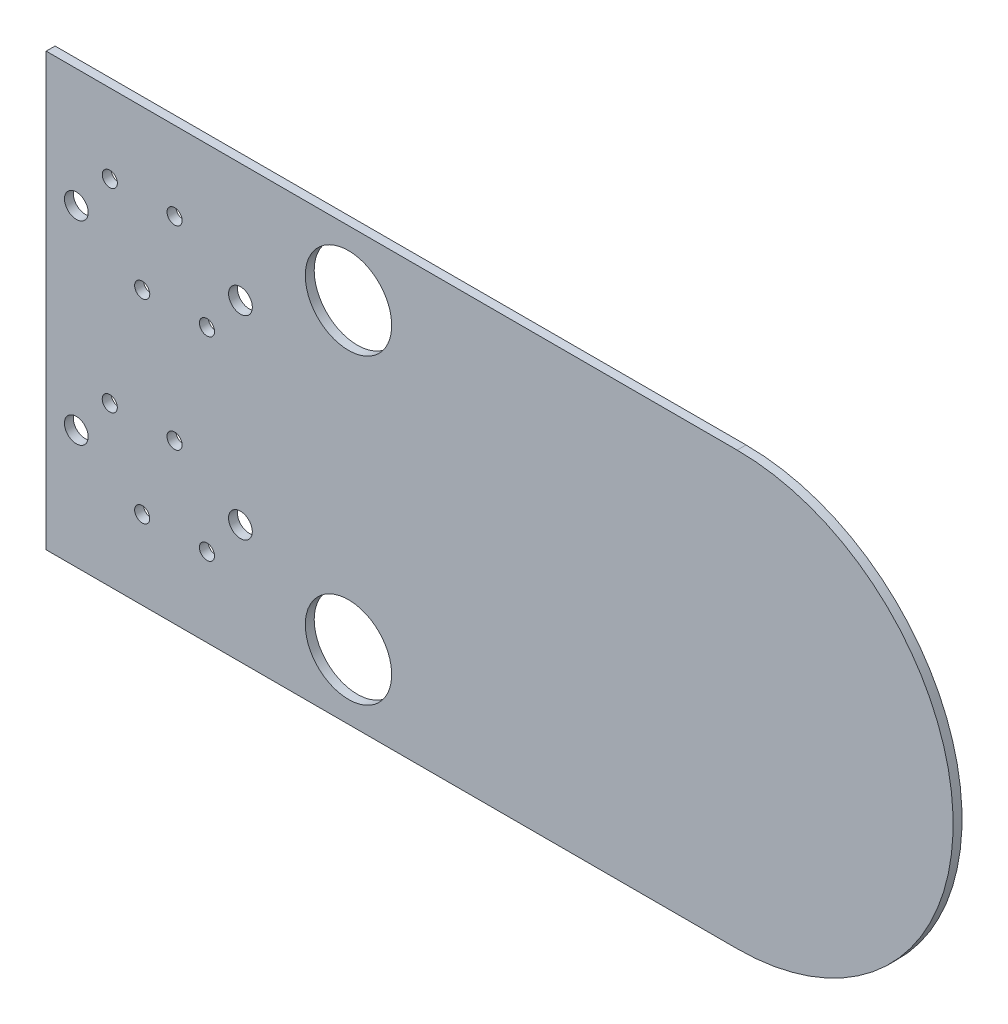
ISO-10303-21;
HEADER;
FILE_DESCRIPTION(('STEP AP214'),'2;1');
FILE_NAME('part.step','',(''),(''),'','','');
FILE_SCHEMA(('AUTOMOTIVE_DESIGN { 1 0 10303 214 1 1 1 1 }'));
ENDSEC;
DATA;
#1=APPLICATION_CONTEXT('core data for automotive mechanical design processes');
#2=APPLICATION_PROTOCOL_DEFINITION('international standard','automotive_design',2000,#1);
#3=PRODUCT_CONTEXT('',#1,'mechanical');
#4=PRODUCT('Part','Part','',(#3));
#5=PRODUCT_RELATED_PRODUCT_CATEGORY('part','',(#4));
#6=PRODUCT_DEFINITION_FORMATION('','',#4);
#7=PRODUCT_DEFINITION_CONTEXT('part definition',#1,'design');
#8=PRODUCT_DEFINITION('design','',#6,#7);
#9=PRODUCT_DEFINITION_SHAPE('','',#8);
#10=(LENGTH_UNIT() NAMED_UNIT(*) SI_UNIT(.MILLI.,.METRE.));
#11=(NAMED_UNIT(*) PLANE_ANGLE_UNIT() SI_UNIT($,.RADIAN.));
#12=(NAMED_UNIT(*) SI_UNIT($,.STERADIAN.) SOLID_ANGLE_UNIT());
#13=UNCERTAINTY_MEASURE_WITH_UNIT(LENGTH_MEASURE(1.E-05),#10,'distance_accuracy_value','');
#14=(GEOMETRIC_REPRESENTATION_CONTEXT(3) GLOBAL_UNCERTAINTY_ASSIGNED_CONTEXT((#13)) GLOBAL_UNIT_ASSIGNED_CONTEXT((#10,
#11,#12)) REPRESENTATION_CONTEXT('',''));
#15=CARTESIAN_POINT('',(0.,0.,0.));
#16=DIRECTION('',(0.,0.,1.));
#17=DIRECTION('',(1.,0.,0.));
#18=AXIS2_PLACEMENT_3D('',#15,#16,#17);
#19=CARTESIAN_POINT('',(18.922851585587,0.,0.41148));
#20=DIRECTION('',(0.,0.,-1.));
#21=DIRECTION('',(-1.,0.,0.));
#22=AXIS2_PLACEMENT_3D('',#19,#20,#21);
#23=PLANE('',#22);
#24=CARTESIAN_POINT('',(14.,7.,0.41148));
#25=DIRECTION('',(0.,0.,-1.));
#26=DIRECTION('',(-1.,0.,0.));
#27=AXIS2_PLACEMENT_3D('',#24,#25,#26);
#28=CIRCLE('',#27,2.);
#29=CARTESIAN_POINT('',(12.,7.,0.41148));
#30=VERTEX_POINT('',#29);
#31=EDGE_CURVE('E82',#30,#30,#28,.T.);
#32=ORIENTED_EDGE('',*,*,#31,.T.);
#33=EDGE_LOOP('',(#32));
#34=FACE_BOUND('',#33,.T.);
#35=CARTESIAN_POINT('',(8.997,4.5,0.41148));
#36=DIRECTION('',(0.,0.,-1.));
#37=DIRECTION('',(-1.,0.,0.));
#38=AXIS2_PLACEMENT_3D('',#35,#36,#37);
#39=CIRCLE('',#38,0.55);
#40=CARTESIAN_POINT('',(8.447,4.5,0.41148));
#41=VERTEX_POINT('',#40);
#42=EDGE_CURVE('E85',#41,#41,#39,.T.);
#43=ORIENTED_EDGE('',*,*,#42,.T.);
#44=EDGE_LOOP('',(#43));
#45=FACE_BOUND('',#44,.T.);
#46=CARTESIAN_POINT('',(5.947,6.35,0.41148));
#47=DIRECTION('',(0.,0.,-1.));
#48=DIRECTION('',(-1.,0.,0.));
#49=AXIS2_PLACEMENT_3D('',#46,#47,#48);
#50=CIRCLE('',#49,0.35);
#51=CARTESIAN_POINT('',(5.597,6.35,0.41148));
#52=VERTEX_POINT('',#51);
#53=EDGE_CURVE('E149',#52,#52,#50,.T.);
#54=ORIENTED_EDGE('',*,*,#53,.T.);
#55=EDGE_LOOP('',(#54));
#56=FACE_BOUND('',#55,.T.);
#57=CARTESIAN_POINT('',(7.447,2.65,0.41148));
#58=DIRECTION('',(0.,0.,-1.));
#59=DIRECTION('',(-1.,0.,0.));
#60=AXIS2_PLACEMENT_3D('',#57,#58,#59);
#61=CIRCLE('',#60,0.35);
#62=CARTESIAN_POINT('',(7.097,2.65,0.41148));
#63=VERTEX_POINT('',#62);
#64=EDGE_CURVE('E152',#63,#63,#61,.T.);
#65=ORIENTED_EDGE('',*,*,#64,.T.);
#66=EDGE_LOOP('',(#65));
#67=FACE_BOUND('',#66,.T.);
#68=CARTESIAN_POINT('',(8.995,-4.5,0.41148));
#69=DIRECTION('',(0.,0.,-1.));
#70=DIRECTION('',(-1.,0.,0.));
#71=AXIS2_PLACEMENT_3D('',#68,#69,#70);
#72=CIRCLE('',#71,0.55);
#73=CARTESIAN_POINT('',(8.445,-4.5,0.41148));
#74=VERTEX_POINT('',#73);
#75=EDGE_CURVE('E155',#74,#74,#72,.T.);
#76=ORIENTED_EDGE('',*,*,#75,.T.);
#77=EDGE_LOOP('',(#76));
#78=FACE_BOUND('',#77,.T.);
#79=CARTESIAN_POINT('',(14.,-7.,0.41148));
#80=DIRECTION('',(0.,0.,-1.));
#81=DIRECTION('',(-1.,0.,0.));
#82=AXIS2_PLACEMENT_3D('',#79,#80,#81);
#83=CIRCLE('',#82,2.);
#84=CARTESIAN_POINT('',(12.,-7.,0.41148));
#85=VERTEX_POINT('',#84);
#86=EDGE_CURVE('E158',#85,#85,#83,.T.);
#87=ORIENTED_EDGE('',*,*,#86,.T.);
#88=EDGE_LOOP('',(#87));
#89=FACE_BOUND('',#88,.T.);
#90=CARTESIAN_POINT('',(7.445,-6.35,0.41148));
#91=DIRECTION('',(0.,0.,-1.));
#92=DIRECTION('',(-1.,0.,0.));
#93=AXIS2_PLACEMENT_3D('',#90,#91,#92);
#94=CIRCLE('',#93,0.35);
#95=CARTESIAN_POINT('',(7.095,-6.35,0.41148));
#96=VERTEX_POINT('',#95);
#97=EDGE_CURVE('E161',#96,#96,#94,.T.);
#98=ORIENTED_EDGE('',*,*,#97,.T.);
#99=EDGE_LOOP('',(#98));
#100=FACE_BOUND('',#99,.T.);
#101=CARTESIAN_POINT('',(4.447,2.65,0.41148));
#102=DIRECTION('',(0.,0.,-1.));
#103=DIRECTION('',(-1.,0.,0.));
#104=AXIS2_PLACEMENT_3D('',#101,#102,#103);
#105=CIRCLE('',#104,0.35);
#106=CARTESIAN_POINT('',(4.097,2.65,0.41148));
#107=VERTEX_POINT('',#106);
#108=EDGE_CURVE('E164',#107,#107,#105,.T.);
#109=ORIENTED_EDGE('',*,*,#108,.T.);
#110=EDGE_LOOP('',(#109));
#111=FACE_BOUND('',#110,.T.);
#112=CARTESIAN_POINT('',(5.945,-2.65,0.41148));
#113=DIRECTION('',(0.,0.,-1.));
#114=DIRECTION('',(-1.,0.,0.));
#115=AXIS2_PLACEMENT_3D('',#112,#113,#114);
#116=CIRCLE('',#115,0.35);
#117=CARTESIAN_POINT('',(5.595,-2.65,0.41148));
#118=VERTEX_POINT('',#117);
#119=EDGE_CURVE('E167',#118,#118,#116,.T.);
#120=ORIENTED_EDGE('',*,*,#119,.T.);
#121=EDGE_LOOP('',(#120));
#122=FACE_BOUND('',#121,.T.);
#123=CARTESIAN_POINT('',(2.947,6.35,0.41148));
#124=DIRECTION('',(0.,0.,-1.));
#125=DIRECTION('',(-1.,0.,0.));
#126=AXIS2_PLACEMENT_3D('',#123,#124,#125);
#127=CIRCLE('',#126,0.35);
#128=CARTESIAN_POINT('',(2.597,6.35,0.41148));
#129=VERTEX_POINT('',#128);
#130=EDGE_CURVE('E170',#129,#129,#127,.T.);
#131=ORIENTED_EDGE('',*,*,#130,.T.);
#132=EDGE_LOOP('',(#131));
#133=FACE_BOUND('',#132,.T.);
#134=CARTESIAN_POINT('',(1.397,4.5,0.41148));
#135=DIRECTION('',(0.,0.,-1.));
#136=DIRECTION('',(-1.,0.,0.));
#137=AXIS2_PLACEMENT_3D('',#134,#135,#136);
#138=CIRCLE('',#137,0.55);
#139=CARTESIAN_POINT('',(0.847,4.5,0.41148));
#140=VERTEX_POINT('',#139);
#141=EDGE_CURVE('E173',#140,#140,#138,.T.);
#142=ORIENTED_EDGE('',*,*,#141,.T.);
#143=EDGE_LOOP('',(#142));
#144=FACE_BOUND('',#143,.T.);
#145=CARTESIAN_POINT('',(2.945,-2.65,0.41148));
#146=DIRECTION('',(0.,0.,-1.));
#147=DIRECTION('',(-1.,0.,0.));
#148=AXIS2_PLACEMENT_3D('',#145,#146,#147);
#149=CIRCLE('',#148,0.35);
#150=CARTESIAN_POINT('',(2.595,-2.65,0.41148));
#151=VERTEX_POINT('',#150);
#152=EDGE_CURVE('E176',#151,#151,#149,.T.);
#153=ORIENTED_EDGE('',*,*,#152,.T.);
#154=EDGE_LOOP('',(#153));
#155=FACE_BOUND('',#154,.T.);
#156=CARTESIAN_POINT('',(4.445,-6.35,0.41148));
#157=DIRECTION('',(0.,0.,-1.));
#158=DIRECTION('',(-1.,0.,0.));
#159=AXIS2_PLACEMENT_3D('',#156,#157,#158);
#160=CIRCLE('',#159,0.35);
#161=CARTESIAN_POINT('',(4.095,-6.35,0.41148));
#162=VERTEX_POINT('',#161);
#163=EDGE_CURVE('E179',#162,#162,#160,.T.);
#164=ORIENTED_EDGE('',*,*,#163,.T.);
#165=EDGE_LOOP('',(#164));
#166=FACE_BOUND('',#165,.T.);
#167=CARTESIAN_POINT('',(1.395,-4.5,0.41148));
#168=DIRECTION('',(0.,0.,-1.));
#169=DIRECTION('',(-1.,0.,0.));
#170=AXIS2_PLACEMENT_3D('',#167,#168,#169);
#171=CIRCLE('',#170,0.55);
#172=CARTESIAN_POINT('',(0.845,-4.5,0.41148));
#173=VERTEX_POINT('',#172);
#174=EDGE_CURVE('E181',#173,#173,#171,.T.);
#175=ORIENTED_EDGE('',*,*,#174,.T.);
#176=EDGE_LOOP('',(#175));
#177=FACE_BOUND('',#176,.T.);
#178=CARTESIAN_POINT('',(32.,0.,0.41148));
#179=DIRECTION('',(0.,0.,-1.));
#180=DIRECTION('',(-1.,0.,0.));
#181=AXIS2_PLACEMENT_3D('',#178,#179,#180);
#182=CIRCLE('',#181,10.);
#183=CARTESIAN_POINT('',(32.,10.,0.41148));
#184=VERTEX_POINT('',#183);
#185=CARTESIAN_POINT('',(32.,-10.,0.41148));
#186=VERTEX_POINT('',#185);
#187=EDGE_CURVE('E20',#184,#186,#182,.T.);
#188=ORIENTED_EDGE('',*,*,#187,.F.);
#189=DIRECTION('',(1.,0.,0.));
#190=VECTOR('',#189,1.);
#191=CARTESIAN_POINT('',(0.,10.,0.41148));
#192=LINE('',#191,#190);
#193=CARTESIAN_POINT('',(0.,10.,0.41148));
#194=VERTEX_POINT('',#193);
#195=EDGE_CURVE('E47',#194,#184,#192,.T.);
#196=ORIENTED_EDGE('',*,*,#195,.F.);
#197=DIRECTION('',(0.,1.,0.));
#198=VECTOR('',#197,1.);
#199=CARTESIAN_POINT('',(0.,-10.,0.41148));
#200=LINE('',#199,#198);
#201=CARTESIAN_POINT('',(0.,-10.,0.41148));
#202=VERTEX_POINT('',#201);
#203=EDGE_CURVE('E56',#202,#194,#200,.T.);
#204=ORIENTED_EDGE('',*,*,#203,.F.);
#205=DIRECTION('',(1.,0.,0.));
#206=VECTOR('',#205,1.);
#207=CARTESIAN_POINT('',(32.,-10.,0.41148));
#208=LINE('',#207,#206);
#209=EDGE_CURVE('E99',#186,#202,#208,.F.);
#210=ORIENTED_EDGE('',*,*,#209,.F.);
#211=EDGE_LOOP('',(#188,#196,#204,#210));
#212=FACE_BOUND('',#211,.T.);
#213=ADVANCED_FACE('F17',(#34,#45,#56,#67,#78,#89,#100,#111,#122,#133,#144,#155,#166,#177,#212),
#23,.F.);
#214=CARTESIAN_POINT('',(0.,-10.,0.));
#215=DIRECTION('',(-1.,0.,0.));
#216=DIRECTION('',(0.,0.,1.));
#217=AXIS2_PLACEMENT_3D('',#214,#215,#216);
#218=PLANE('',#217);
#219=DIRECTION('',(0.,0.,1.));
#220=VECTOR('',#219,1.);
#221=CARTESIAN_POINT('',(0.,10.,0.));
#222=LINE('',#221,#220);
#223=CARTESIAN_POINT('',(0.,10.,0.));
#224=VERTEX_POINT('',#223);
#225=EDGE_CURVE('E66',#224,#194,#222,.T.);
#226=ORIENTED_EDGE('',*,*,#225,.F.);
#227=DIRECTION('',(0.,1.,0.));
#228=VECTOR('',#227,1.);
#229=CARTESIAN_POINT('',(0.,0.,0.));
#230=LINE('',#229,#228);
#231=CARTESIAN_POINT('',(0.,-10.,0.));
#232=VERTEX_POINT('',#231);
#233=EDGE_CURVE('E64',#232,#224,#230,.T.);
#234=ORIENTED_EDGE('',*,*,#233,.F.);
#235=DIRECTION('',(0.,0.,-1.));
#236=VECTOR('',#235,1.);
#237=CARTESIAN_POINT('',(0.,-10.,0.));
#238=LINE('',#237,#236);
#239=EDGE_CURVE('E102',#202,#232,#238,.T.);
#240=ORIENTED_EDGE('',*,*,#239,.F.);
#241=ORIENTED_EDGE('',*,*,#203,.T.);
#242=EDGE_LOOP('',(#226,#234,#240,#241));
#243=FACE_BOUND('',#242,.T.);
#244=ADVANCED_FACE('F68',(#243),#218,.T.);
#245=CARTESIAN_POINT('',(0.,10.,0.));
#246=DIRECTION('',(0.,1.,0.));
#247=DIRECTION('',(0.,0.,1.));
#248=AXIS2_PLACEMENT_3D('',#245,#246,#247);
#249=PLANE('',#248);
#250=DIRECTION('',(0.,0.,-1.));
#251=VECTOR('',#250,1.);
#252=CARTESIAN_POINT('',(32.,10.,0.));
#253=LINE('',#252,#251);
#254=CARTESIAN_POINT('',(32.,10.,0.));
#255=VERTEX_POINT('',#254);
#256=EDGE_CURVE('E74',#255,#184,#253,.F.);
#257=ORIENTED_EDGE('',*,*,#256,.F.);
#258=DIRECTION('',(-1.,0.,0.));
#259=VECTOR('',#258,1.);
#260=CARTESIAN_POINT('',(18.922851585587,10.,0.));
#261=LINE('',#260,#259);
#262=EDGE_CURVE('E71',#224,#255,#261,.F.);
#263=ORIENTED_EDGE('',*,*,#262,.F.);
#264=ORIENTED_EDGE('',*,*,#225,.T.);
#265=ORIENTED_EDGE('',*,*,#195,.T.);
#266=EDGE_LOOP('',(#257,#263,#264,#265));
#267=FACE_BOUND('',#266,.T.);
#268=ADVANCED_FACE('F72',(#267),#249,.T.);
#269=CARTESIAN_POINT('',(32.,0.,0.));
#270=DIRECTION('',(0.,0.,-1.));
#271=DIRECTION('',(-1.,0.,0.));
#272=AXIS2_PLACEMENT_3D('',#269,#270,#271);
#273=CYLINDRICAL_SURFACE('',#272,10.);
#274=DIRECTION('',(0.,0.,-1.));
#275=VECTOR('',#274,1.);
#276=CARTESIAN_POINT('',(32.,-10.,0.));
#277=LINE('',#276,#275);
#278=CARTESIAN_POINT('',(32.,-10.,0.));
#279=VERTEX_POINT('',#278);
#280=EDGE_CURVE('E35',#279,#186,#277,.F.);
#281=ORIENTED_EDGE('',*,*,#280,.F.);
#282=CARTESIAN_POINT('',(32.,0.,0.));
#283=DIRECTION('',(0.,0.,-1.));
#284=DIRECTION('',(-1.,0.,0.));
#285=AXIS2_PLACEMENT_3D('',#282,#283,#284);
#286=CIRCLE('',#285,10.);
#287=EDGE_CURVE('E77',#255,#279,#286,.T.);
#288=ORIENTED_EDGE('',*,*,#287,.F.);
#289=ORIENTED_EDGE('',*,*,#256,.T.);
#290=ORIENTED_EDGE('',*,*,#187,.T.);
#291=EDGE_LOOP('',(#281,#288,#289,#290));
#292=FACE_BOUND('',#291,.T.);
#293=ADVANCED_FACE('F192',(#292),#273,.T.);
#294=CARTESIAN_POINT('',(32.,-10.,0.));
#295=DIRECTION('',(0.,-1.,0.));
#296=DIRECTION('',(0.,0.,-1.));
#297=AXIS2_PLACEMENT_3D('',#294,#295,#296);
#298=PLANE('',#297);
#299=ORIENTED_EDGE('',*,*,#239,.T.);
#300=DIRECTION('',(-1.,0.,0.));
#301=VECTOR('',#300,1.);
#302=CARTESIAN_POINT('',(18.922851585587,-10.,0.));
#303=LINE('',#302,#301);
#304=EDGE_CURVE('E81',#279,#232,#303,.T.);
#305=ORIENTED_EDGE('',*,*,#304,.F.);
#306=ORIENTED_EDGE('',*,*,#280,.T.);
#307=ORIENTED_EDGE('',*,*,#209,.T.);
#308=EDGE_LOOP('',(#299,#305,#306,#307));
#309=FACE_BOUND('',#308,.T.);
#310=ADVANCED_FACE('F193',(#309),#298,.T.);
#311=CARTESIAN_POINT('',(1.395,-4.5,0.));
#312=DIRECTION('',(0.,0.,-1.));
#313=DIRECTION('',(-1.,0.,0.));
#314=AXIS2_PLACEMENT_3D('',#311,#312,#313);
#315=CYLINDRICAL_SURFACE('',#314,0.55);
#316=ORIENTED_EDGE('',*,*,#174,.F.);
#317=EDGE_LOOP('',(#316));
#318=FACE_BOUND('',#317,.T.);
#319=CARTESIAN_POINT('',(1.395,-4.5,0.));
#320=DIRECTION('',(0.,0.,-1.));
#321=DIRECTION('',(-1.,0.,0.));
#322=AXIS2_PLACEMENT_3D('',#319,#320,#321);
#323=CIRCLE('',#322,0.55);
#324=CARTESIAN_POINT('',(0.845,-4.5,0.));
#325=VERTEX_POINT('',#324);
#326=EDGE_CURVE('E143',#325,#325,#323,.F.);
#327=ORIENTED_EDGE('',*,*,#326,.F.);
#328=EDGE_LOOP('',(#327));
#329=FACE_BOUND('',#328,.T.);
#330=ADVANCED_FACE('F195',(#318,#329),#315,.F.);
#331=CARTESIAN_POINT('',(4.445,-6.35,0.));
#332=DIRECTION('',(0.,0.,-1.));
#333=DIRECTION('',(-1.,0.,0.));
#334=AXIS2_PLACEMENT_3D('',#331,#332,#333);
#335=CYLINDRICAL_SURFACE('',#334,0.35);
#336=ORIENTED_EDGE('',*,*,#163,.F.);
#337=EDGE_LOOP('',(#336));
#338=FACE_BOUND('',#337,.T.);
#339=CARTESIAN_POINT('',(4.445,-6.35,0.));
#340=DIRECTION('',(0.,0.,-1.));
#341=DIRECTION('',(-1.,0.,0.));
#342=AXIS2_PLACEMENT_3D('',#339,#340,#341);
#343=CIRCLE('',#342,0.35);
#344=CARTESIAN_POINT('',(4.095,-6.35,0.));
#345=VERTEX_POINT('',#344);
#346=EDGE_CURVE('E140',#345,#345,#343,.F.);
#347=ORIENTED_EDGE('',*,*,#346,.F.);
#348=EDGE_LOOP('',(#347));
#349=FACE_BOUND('',#348,.T.);
#350=ADVANCED_FACE('F202',(#338,#349),#335,.F.);
#351=CARTESIAN_POINT('',(2.945,-2.65,0.));
#352=DIRECTION('',(0.,0.,-1.));
#353=DIRECTION('',(-1.,0.,0.));
#354=AXIS2_PLACEMENT_3D('',#351,#352,#353);
#355=CYLINDRICAL_SURFACE('',#354,0.35);
#356=ORIENTED_EDGE('',*,*,#152,.F.);
#357=EDGE_LOOP('',(#356));
#358=FACE_BOUND('',#357,.T.);
#359=CARTESIAN_POINT('',(2.945,-2.65,0.));
#360=DIRECTION('',(0.,0.,-1.));
#361=DIRECTION('',(-1.,0.,0.));
#362=AXIS2_PLACEMENT_3D('',#359,#360,#361);
#363=CIRCLE('',#362,0.35);
#364=CARTESIAN_POINT('',(2.595,-2.65,0.));
#365=VERTEX_POINT('',#364);
#366=EDGE_CURVE('E137',#365,#365,#363,.F.);
#367=ORIENTED_EDGE('',*,*,#366,.F.);
#368=EDGE_LOOP('',(#367));
#369=FACE_BOUND('',#368,.T.);
#370=ADVANCED_FACE('F256',(#358,#369),#355,.F.);
#371=CARTESIAN_POINT('',(1.397,4.5,0.));
#372=DIRECTION('',(0.,0.,-1.));
#373=DIRECTION('',(-1.,0.,0.));
#374=AXIS2_PLACEMENT_3D('',#371,#372,#373);
#375=CYLINDRICAL_SURFACE('',#374,0.55);
#376=ORIENTED_EDGE('',*,*,#141,.F.);
#377=EDGE_LOOP('',(#376));
#378=FACE_BOUND('',#377,.T.);
#379=CARTESIAN_POINT('',(1.397,4.5,0.));
#380=DIRECTION('',(0.,0.,-1.));
#381=DIRECTION('',(-1.,0.,0.));
#382=AXIS2_PLACEMENT_3D('',#379,#380,#381);
#383=CIRCLE('',#382,0.55);
#384=CARTESIAN_POINT('',(0.847,4.5,0.));
#385=VERTEX_POINT('',#384);
#386=EDGE_CURVE('E134',#385,#385,#383,.F.);
#387=ORIENTED_EDGE('',*,*,#386,.F.);
#388=EDGE_LOOP('',(#387));
#389=FACE_BOUND('',#388,.T.);
#390=ADVANCED_FACE('F252',(#378,#389),#375,.F.);
#391=CARTESIAN_POINT('',(2.947,6.35,0.));
#392=DIRECTION('',(0.,0.,-1.));
#393=DIRECTION('',(-1.,0.,0.));
#394=AXIS2_PLACEMENT_3D('',#391,#392,#393);
#395=CYLINDRICAL_SURFACE('',#394,0.35);
#396=ORIENTED_EDGE('',*,*,#130,.F.);
#397=EDGE_LOOP('',(#396));
#398=FACE_BOUND('',#397,.T.);
#399=CARTESIAN_POINT('',(2.947,6.35,0.));
#400=DIRECTION('',(0.,0.,-1.));
#401=DIRECTION('',(-1.,0.,0.));
#402=AXIS2_PLACEMENT_3D('',#399,#400,#401);
#403=CIRCLE('',#402,0.35);
#404=CARTESIAN_POINT('',(2.597,6.35,0.));
#405=VERTEX_POINT('',#404);
#406=EDGE_CURVE('E131',#405,#405,#403,.F.);
#407=ORIENTED_EDGE('',*,*,#406,.F.);
#408=EDGE_LOOP('',(#407));
#409=FACE_BOUND('',#408,.T.);
#410=ADVANCED_FACE('F248',(#398,#409),#395,.F.);
#411=CARTESIAN_POINT('',(5.945,-2.65,0.));
#412=DIRECTION('',(0.,0.,-1.));
#413=DIRECTION('',(-1.,0.,0.));
#414=AXIS2_PLACEMENT_3D('',#411,#412,#413);
#415=CYLINDRICAL_SURFACE('',#414,0.35);
#416=ORIENTED_EDGE('',*,*,#119,.F.);
#417=EDGE_LOOP('',(#416));
#418=FACE_BOUND('',#417,.T.);
#419=CARTESIAN_POINT('',(5.945,-2.65,0.));
#420=DIRECTION('',(0.,0.,-1.));
#421=DIRECTION('',(-1.,0.,0.));
#422=AXIS2_PLACEMENT_3D('',#419,#420,#421);
#423=CIRCLE('',#422,0.35);
#424=CARTESIAN_POINT('',(5.595,-2.65,0.));
#425=VERTEX_POINT('',#424);
#426=EDGE_CURVE('E128',#425,#425,#423,.F.);
#427=ORIENTED_EDGE('',*,*,#426,.F.);
#428=EDGE_LOOP('',(#427));
#429=FACE_BOUND('',#428,.T.);
#430=ADVANCED_FACE('F244',(#418,#429),#415,.F.);
#431=CARTESIAN_POINT('',(4.447,2.65,0.));
#432=DIRECTION('',(0.,0.,-1.));
#433=DIRECTION('',(-1.,0.,0.));
#434=AXIS2_PLACEMENT_3D('',#431,#432,#433);
#435=CYLINDRICAL_SURFACE('',#434,0.35);
#436=ORIENTED_EDGE('',*,*,#108,.F.);
#437=EDGE_LOOP('',(#436));
#438=FACE_BOUND('',#437,.T.);
#439=CARTESIAN_POINT('',(4.447,2.65,0.));
#440=DIRECTION('',(0.,0.,-1.));
#441=DIRECTION('',(-1.,0.,0.));
#442=AXIS2_PLACEMENT_3D('',#439,#440,#441);
#443=CIRCLE('',#442,0.35);
#444=CARTESIAN_POINT('',(4.097,2.65,0.));
#445=VERTEX_POINT('',#444);
#446=EDGE_CURVE('E125',#445,#445,#443,.F.);
#447=ORIENTED_EDGE('',*,*,#446,.F.);
#448=EDGE_LOOP('',(#447));
#449=FACE_BOUND('',#448,.T.);
#450=ADVANCED_FACE('F240',(#438,#449),#435,.F.);
#451=CARTESIAN_POINT('',(7.445,-6.35,0.));
#452=DIRECTION('',(0.,0.,-1.));
#453=DIRECTION('',(-1.,0.,0.));
#454=AXIS2_PLACEMENT_3D('',#451,#452,#453);
#455=CYLINDRICAL_SURFACE('',#454,0.35);
#456=ORIENTED_EDGE('',*,*,#97,.F.);
#457=EDGE_LOOP('',(#456));
#458=FACE_BOUND('',#457,.T.);
#459=CARTESIAN_POINT('',(7.445,-6.35,0.));
#460=DIRECTION('',(0.,0.,-1.));
#461=DIRECTION('',(-1.,0.,0.));
#462=AXIS2_PLACEMENT_3D('',#459,#460,#461);
#463=CIRCLE('',#462,0.35);
#464=CARTESIAN_POINT('',(7.095,-6.35,0.));
#465=VERTEX_POINT('',#464);
#466=EDGE_CURVE('E122',#465,#465,#463,.F.);
#467=ORIENTED_EDGE('',*,*,#466,.F.);
#468=EDGE_LOOP('',(#467));
#469=FACE_BOUND('',#468,.T.);
#470=ADVANCED_FACE('F236',(#458,#469),#455,.F.);
#471=CARTESIAN_POINT('',(14.,-7.,0.));
#472=DIRECTION('',(0.,0.,-1.));
#473=DIRECTION('',(-1.,0.,0.));
#474=AXIS2_PLACEMENT_3D('',#471,#472,#473);
#475=CYLINDRICAL_SURFACE('',#474,2.);
#476=ORIENTED_EDGE('',*,*,#86,.F.);
#477=EDGE_LOOP('',(#476));
#478=FACE_BOUND('',#477,.T.);
#479=CARTESIAN_POINT('',(14.,-7.,0.));
#480=DIRECTION('',(0.,0.,-1.));
#481=DIRECTION('',(-1.,0.,0.));
#482=AXIS2_PLACEMENT_3D('',#479,#480,#481);
#483=CIRCLE('',#482,2.);
#484=CARTESIAN_POINT('',(12.,-7.,0.));
#485=VERTEX_POINT('',#484);
#486=EDGE_CURVE('E119',#485,#485,#483,.F.);
#487=ORIENTED_EDGE('',*,*,#486,.F.);
#488=EDGE_LOOP('',(#487));
#489=FACE_BOUND('',#488,.T.);
#490=ADVANCED_FACE('F232',(#478,#489),#475,.F.);
#491=CARTESIAN_POINT('',(8.995,-4.5,0.));
#492=DIRECTION('',(0.,0.,-1.));
#493=DIRECTION('',(-1.,0.,0.));
#494=AXIS2_PLACEMENT_3D('',#491,#492,#493);
#495=CYLINDRICAL_SURFACE('',#494,0.55);
#496=ORIENTED_EDGE('',*,*,#75,.F.);
#497=EDGE_LOOP('',(#496));
#498=FACE_BOUND('',#497,.T.);
#499=CARTESIAN_POINT('',(8.995,-4.5,0.));
#500=DIRECTION('',(0.,0.,-1.));
#501=DIRECTION('',(-1.,0.,0.));
#502=AXIS2_PLACEMENT_3D('',#499,#500,#501);
#503=CIRCLE('',#502,0.55);
#504=CARTESIAN_POINT('',(8.445,-4.5,0.));
#505=VERTEX_POINT('',#504);
#506=EDGE_CURVE('E116',#505,#505,#503,.F.);
#507=ORIENTED_EDGE('',*,*,#506,.F.);
#508=EDGE_LOOP('',(#507));
#509=FACE_BOUND('',#508,.T.);
#510=ADVANCED_FACE('F228',(#498,#509),#495,.F.);
#511=CARTESIAN_POINT('',(7.447,2.65,0.));
#512=DIRECTION('',(0.,0.,-1.));
#513=DIRECTION('',(-1.,0.,0.));
#514=AXIS2_PLACEMENT_3D('',#511,#512,#513);
#515=CYLINDRICAL_SURFACE('',#514,0.35);
#516=ORIENTED_EDGE('',*,*,#64,.F.);
#517=EDGE_LOOP('',(#516));
#518=FACE_BOUND('',#517,.T.);
#519=CARTESIAN_POINT('',(7.447,2.65,0.));
#520=DIRECTION('',(0.,0.,-1.));
#521=DIRECTION('',(-1.,0.,0.));
#522=AXIS2_PLACEMENT_3D('',#519,#520,#521);
#523=CIRCLE('',#522,0.35);
#524=CARTESIAN_POINT('',(7.097,2.65,0.));
#525=VERTEX_POINT('',#524);
#526=EDGE_CURVE('E113',#525,#525,#523,.F.);
#527=ORIENTED_EDGE('',*,*,#526,.F.);
#528=EDGE_LOOP('',(#527));
#529=FACE_BOUND('',#528,.T.);
#530=ADVANCED_FACE('F224',(#518,#529),#515,.F.);
#531=CARTESIAN_POINT('',(5.947,6.35,0.));
#532=DIRECTION('',(0.,0.,-1.));
#533=DIRECTION('',(-1.,0.,0.));
#534=AXIS2_PLACEMENT_3D('',#531,#532,#533);
#535=CYLINDRICAL_SURFACE('',#534,0.35);
#536=ORIENTED_EDGE('',*,*,#53,.F.);
#537=EDGE_LOOP('',(#536));
#538=FACE_BOUND('',#537,.T.);
#539=CARTESIAN_POINT('',(5.947,6.35,0.));
#540=DIRECTION('',(0.,0.,-1.));
#541=DIRECTION('',(-1.,0.,0.));
#542=AXIS2_PLACEMENT_3D('',#539,#540,#541);
#543=CIRCLE('',#542,0.35);
#544=CARTESIAN_POINT('',(5.597,6.35,0.));
#545=VERTEX_POINT('',#544);
#546=EDGE_CURVE('E110',#545,#545,#543,.F.);
#547=ORIENTED_EDGE('',*,*,#546,.F.);
#548=EDGE_LOOP('',(#547));
#549=FACE_BOUND('',#548,.T.);
#550=ADVANCED_FACE('F220',(#538,#549),#535,.F.);
#551=CARTESIAN_POINT('',(8.997,4.5,0.));
#552=DIRECTION('',(0.,0.,-1.));
#553=DIRECTION('',(-1.,0.,0.));
#554=AXIS2_PLACEMENT_3D('',#551,#552,#553);
#555=CYLINDRICAL_SURFACE('',#554,0.55);
#556=ORIENTED_EDGE('',*,*,#42,.F.);
#557=EDGE_LOOP('',(#556));
#558=FACE_BOUND('',#557,.T.);
#559=CARTESIAN_POINT('',(8.997,4.5,0.));
#560=DIRECTION('',(0.,0.,-1.));
#561=DIRECTION('',(-1.,0.,0.));
#562=AXIS2_PLACEMENT_3D('',#559,#560,#561);
#563=CIRCLE('',#562,0.55);
#564=CARTESIAN_POINT('',(8.447,4.5,0.));
#565=VERTEX_POINT('',#564);
#566=EDGE_CURVE('E26',#565,#565,#563,.F.);
#567=ORIENTED_EDGE('',*,*,#566,.F.);
#568=EDGE_LOOP('',(#567));
#569=FACE_BOUND('',#568,.T.);
#570=ADVANCED_FACE('F213',(#558,#569),#555,.F.);
#571=CARTESIAN_POINT('',(14.,7.,0.));
#572=DIRECTION('',(0.,0.,-1.));
#573=DIRECTION('',(-1.,0.,0.));
#574=AXIS2_PLACEMENT_3D('',#571,#572,#573);
#575=CYLINDRICAL_SURFACE('',#574,2.);
#576=ORIENTED_EDGE('',*,*,#31,.F.);
#577=EDGE_LOOP('',(#576));
#578=FACE_BOUND('',#577,.T.);
#579=CARTESIAN_POINT('',(14.,7.,0.));
#580=DIRECTION('',(0.,0.,-1.));
#581=DIRECTION('',(-1.,0.,0.));
#582=AXIS2_PLACEMENT_3D('',#579,#580,#581);
#583=CIRCLE('',#582,2.);
#584=CARTESIAN_POINT('',(12.,7.,0.));
#585=VERTEX_POINT('',#584);
#586=EDGE_CURVE('E11',#585,#585,#583,.F.);
#587=ORIENTED_EDGE('',*,*,#586,.F.);
#588=EDGE_LOOP('',(#587));
#589=FACE_BOUND('',#588,.T.);
#590=ADVANCED_FACE('F207',(#578,#589),#575,.F.);
#591=CARTESIAN_POINT('',(18.922851585587,0.,0.));
#592=DIRECTION('',(0.,0.,-1.));
#593=DIRECTION('',(-1.,0.,0.));
#594=AXIS2_PLACEMENT_3D('',#591,#592,#593);
#595=PLANE('',#594);
#596=ORIENTED_EDGE('',*,*,#586,.T.);
#597=EDGE_LOOP('',(#596));
#598=FACE_BOUND('',#597,.T.);
#599=ORIENTED_EDGE('',*,*,#566,.T.);
#600=EDGE_LOOP('',(#599));
#601=FACE_BOUND('',#600,.T.);
#602=ORIENTED_EDGE('',*,*,#546,.T.);
#603=EDGE_LOOP('',(#602));
#604=FACE_BOUND('',#603,.T.);
#605=ORIENTED_EDGE('',*,*,#526,.T.);
#606=EDGE_LOOP('',(#605));
#607=FACE_BOUND('',#606,.T.);
#608=ORIENTED_EDGE('',*,*,#506,.T.);
#609=EDGE_LOOP('',(#608));
#610=FACE_BOUND('',#609,.T.);
#611=ORIENTED_EDGE('',*,*,#486,.T.);
#612=EDGE_LOOP('',(#611));
#613=FACE_BOUND('',#612,.T.);
#614=ORIENTED_EDGE('',*,*,#466,.T.);
#615=EDGE_LOOP('',(#614));
#616=FACE_BOUND('',#615,.T.);
#617=ORIENTED_EDGE('',*,*,#446,.T.);
#618=EDGE_LOOP('',(#617));
#619=FACE_BOUND('',#618,.T.);
#620=ORIENTED_EDGE('',*,*,#426,.T.);
#621=EDGE_LOOP('',(#620));
#622=FACE_BOUND('',#621,.T.);
#623=ORIENTED_EDGE('',*,*,#406,.T.);
#624=EDGE_LOOP('',(#623));
#625=FACE_BOUND('',#624,.T.);
#626=ORIENTED_EDGE('',*,*,#386,.T.);
#627=EDGE_LOOP('',(#626));
#628=FACE_BOUND('',#627,.T.);
#629=ORIENTED_EDGE('',*,*,#366,.T.);
#630=EDGE_LOOP('',(#629));
#631=FACE_BOUND('',#630,.T.);
#632=ORIENTED_EDGE('',*,*,#346,.T.);
#633=EDGE_LOOP('',(#632));
#634=FACE_BOUND('',#633,.T.);
#635=ORIENTED_EDGE('',*,*,#326,.T.);
#636=EDGE_LOOP('',(#635));
#637=FACE_BOUND('',#636,.T.);
#638=ORIENTED_EDGE('',*,*,#287,.T.);
#639=ORIENTED_EDGE('',*,*,#304,.T.);
#640=ORIENTED_EDGE('',*,*,#233,.T.);
#641=ORIENTED_EDGE('',*,*,#262,.T.);
#642=EDGE_LOOP('',(#638,#639,#640,#641));
#643=FACE_BOUND('',#642,.T.);
#644=ADVANCED_FACE('F80',(#598,#601,#604,#607,#610,#613,#616,#619,#622,#625,#628,#631,#634,#637,
#643),#595,.T.);
#645=CLOSED_SHELL('',(#213,#244,#268,#293,#310,#330,#350,#370,#390,#410,#430,#450,#470,#490,
#510,#530,#550,#570,#590,#644));
#646=MANIFOLD_SOLID_BREP('B1',#645);
#647=ADVANCED_BREP_SHAPE_REPRESENTATION('',(#18,#646),#14);
#648=SHAPE_DEFINITION_REPRESENTATION(#9,#647);
ENDSEC;
END-ISO-10303-21;
